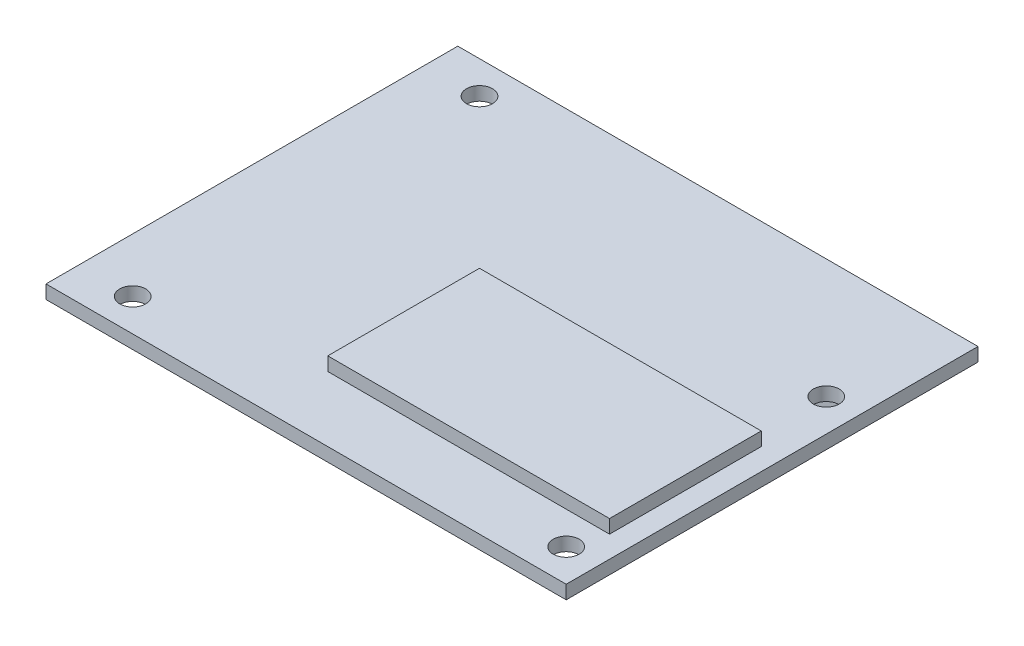
ISO-10303-21;
HEADER;
FILE_DESCRIPTION(('STEP AP214'),'2;1');
FILE_NAME('part.step','',(''),(''),'','','');
FILE_SCHEMA(('AUTOMOTIVE_DESIGN { 1 0 10303 214 1 1 1 1 }'));
ENDSEC;
DATA;
#1=APPLICATION_CONTEXT('core data for automotive mechanical design processes');
#2=APPLICATION_PROTOCOL_DEFINITION('international standard','automotive_design',2000,#1);
#3=PRODUCT_CONTEXT('',#1,'mechanical');
#4=PRODUCT('Part','Part','',(#3));
#5=PRODUCT_RELATED_PRODUCT_CATEGORY('part','',(#4));
#6=PRODUCT_DEFINITION_FORMATION('','',#4);
#7=PRODUCT_DEFINITION_CONTEXT('part definition',#1,'design');
#8=PRODUCT_DEFINITION('design','',#6,#7);
#9=PRODUCT_DEFINITION_SHAPE('','',#8);
#10=(LENGTH_UNIT() NAMED_UNIT(*) SI_UNIT(.MILLI.,.METRE.));
#11=(NAMED_UNIT(*) PLANE_ANGLE_UNIT() SI_UNIT($,.RADIAN.));
#12=(NAMED_UNIT(*) SI_UNIT($,.STERADIAN.) SOLID_ANGLE_UNIT());
#13=UNCERTAINTY_MEASURE_WITH_UNIT(LENGTH_MEASURE(1.E-05),#10,'distance_accuracy_value','');
#14=(GEOMETRIC_REPRESENTATION_CONTEXT(3) GLOBAL_UNCERTAINTY_ASSIGNED_CONTEXT((#13)) GLOBAL_UNIT_ASSIGNED_CONTEXT((#10,
#11,#12)) REPRESENTATION_CONTEXT('',''));
#15=CARTESIAN_POINT('',(0.,0.,0.));
#16=DIRECTION('',(0.,0.,1.));
#17=DIRECTION('',(1.,0.,0.));
#18=AXIS2_PLACEMENT_3D('',#15,#16,#17);
#19=CARTESIAN_POINT('',(0.,0.,0.));
#20=DIRECTION('',(0.,1.,0.));
#21=DIRECTION('',(0.,0.,1.));
#22=AXIS2_PLACEMENT_3D('',#19,#20,#21);
#23=PLANE('',#22);
#24=DIRECTION('',(0.,0.,1.));
#25=VECTOR('',#24,1.);
#26=CARTESIAN_POINT('',(-29.4723855401664,0.,-18.6705179282869));
#27=LINE('',#26,#25);
#28=CARTESIAN_POINT('',(-29.4723855401664,0.,-18.6705179282869));
#29=VERTEX_POINT('',#28);
#30=CARTESIAN_POINT('',(-29.4723855401664,0.,29.5894820717131));
#31=VERTEX_POINT('',#30);
#32=EDGE_CURVE('E238',#29,#31,#27,.T.);
#33=ORIENTED_EDGE('',*,*,#32,.F.);
#34=DIRECTION('',(-1.,0.,0.));
#35=VECTOR('',#34,1.);
#36=CARTESIAN_POINT('',(-29.4723855401664,0.,-18.6705179282869));
#37=LINE('',#36,#35);
#38=CARTESIAN_POINT('',(31.4876144598336,0.,-18.6705179282869));
#39=VERTEX_POINT('',#38);
#40=EDGE_CURVE('E244',#39,#29,#37,.T.);
#41=ORIENTED_EDGE('',*,*,#40,.F.);
#42=DIRECTION('',(0.,0.,-1.));
#43=VECTOR('',#42,1.);
#44=CARTESIAN_POINT('',(31.4876144598336,0.,-18.6705179282869));
#45=LINE('',#44,#43);
#46=CARTESIAN_POINT('',(31.4876144598336,0.,29.5894820717131));
#47=VERTEX_POINT('',#46);
#48=EDGE_CURVE('E260',#47,#39,#45,.T.);
#49=ORIENTED_EDGE('',*,*,#48,.F.);
#50=DIRECTION('',(1.,0.,0.));
#51=VECTOR('',#50,1.);
#52=CARTESIAN_POINT('',(-29.4723855401664,0.,29.5894820717131));
#53=LINE('',#52,#51);
#54=EDGE_CURVE('E257',#31,#47,#53,.T.);
#55=ORIENTED_EDGE('',*,*,#54,.F.);
#56=EDGE_LOOP('',(#33,#41,#49,#55));
#57=FACE_BOUND('',#56,.T.);
#58=CARTESIAN_POINT('',(27.6776144598336,0.,-4.70051792828686));
#59=DIRECTION('',(0.,1.,0.));
#60=DIRECTION('',(0.,0.,1.));
#61=AXIS2_PLACEMENT_3D('',#58,#59,#60);
#62=CIRCLE('',#61,1.52399999999999);
#63=CARTESIAN_POINT('',(27.6776144598336,0.,-3.17651792828687));
#64=VERTEX_POINT('',#63);
#65=EDGE_CURVE('E175',#64,#64,#62,.T.);
#66=ORIENTED_EDGE('',*,*,#65,.T.);
#67=EDGE_LOOP('',(#66));
#68=FACE_BOUND('',#67,.T.);
#69=CARTESIAN_POINT('',(-23.1223855401664,0.,25.7794820717131));
#70=DIRECTION('',(0.,1.,0.));
#71=DIRECTION('',(0.,0.,1.));
#72=AXIS2_PLACEMENT_3D('',#69,#70,#71);
#73=CIRCLE('',#72,1.52399999999999);
#74=CARTESIAN_POINT('',(-23.1223855401664,0.,27.3034820717131));
#75=VERTEX_POINT('',#74);
#76=EDGE_CURVE('E187',#75,#75,#73,.T.);
#77=ORIENTED_EDGE('',*,*,#76,.T.);
#78=EDGE_LOOP('',(#77));
#79=FACE_BOUND('',#78,.T.);
#80=CARTESIAN_POINT('',(27.6776144598336,0.,25.7794820717131));
#81=DIRECTION('',(0.,1.,0.));
#82=DIRECTION('',(0.,0.,1.));
#83=AXIS2_PLACEMENT_3D('',#80,#81,#82);
#84=CIRCLE('',#83,1.52399999999999);
#85=CARTESIAN_POINT('',(27.6776144598336,0.,27.3034820717131));
#86=VERTEX_POINT('',#85);
#87=EDGE_CURVE('E160',#86,#86,#84,.T.);
#88=ORIENTED_EDGE('',*,*,#87,.T.);
#89=EDGE_LOOP('',(#88));
#90=FACE_BOUND('',#89,.T.);
#91=CARTESIAN_POINT('',(-23.1223855401664,0.,-14.8605179282869));
#92=DIRECTION('',(0.,1.,0.));
#93=DIRECTION('',(0.,0.,1.));
#94=AXIS2_PLACEMENT_3D('',#91,#92,#93);
#95=CIRCLE('',#94,1.52399999999999);
#96=CARTESIAN_POINT('',(-23.1223855401664,0.,-13.3365179282869));
#97=VERTEX_POINT('',#96);
#98=EDGE_CURVE('E166',#97,#97,#95,.T.);
#99=ORIENTED_EDGE('',*,*,#98,.T.);
#100=EDGE_LOOP('',(#99));
#101=FACE_BOUND('',#100,.T.);
#102=DIRECTION('',(0.,0.,-1.));
#103=VECTOR('',#102,1.);
#104=CARTESIAN_POINT('',(8.62761445983358,0.,-13.5905179282869));
#105=LINE('',#104,#103);
#106=CARTESIAN_POINT('',(8.62761445983358,0.,-13.5905179282869));
#107=VERTEX_POINT('',#106);
#108=CARTESIAN_POINT('',(8.62761445983358,0.,-16.1305179282869));
#109=VERTEX_POINT('',#108);
#110=EDGE_CURVE('E153',#107,#109,#105,.T.);
#111=ORIENTED_EDGE('',*,*,#110,.F.);
#112=DIRECTION('',(-1.,0.,0.));
#113=VECTOR('',#112,1.);
#114=CARTESIAN_POINT('',(8.62761445983358,0.,-13.5905179282869));
#115=LINE('',#114,#113);
#116=CARTESIAN_POINT('',(21.3276144598336,0.,-13.5905179282869));
#117=VERTEX_POINT('',#116);
#118=EDGE_CURVE('E150',#117,#107,#115,.T.);
#119=ORIENTED_EDGE('',*,*,#118,.F.);
#120=DIRECTION('',(0.,0.,1.));
#121=VECTOR('',#120,1.);
#122=CARTESIAN_POINT('',(21.3276144598336,0.,-13.5905179282869));
#123=LINE('',#122,#121);
#124=CARTESIAN_POINT('',(21.3276144598336,0.,-16.1305179282869));
#125=VERTEX_POINT('',#124);
#126=EDGE_CURVE('E62',#125,#117,#123,.T.);
#127=ORIENTED_EDGE('',*,*,#126,.F.);
#128=DIRECTION('',(1.,0.,0.));
#129=VECTOR('',#128,1.);
#130=CARTESIAN_POINT('',(8.62761445983358,0.,-16.1305179282869));
#131=LINE('',#130,#129);
#132=EDGE_CURVE('E57',#109,#125,#131,.T.);
#133=ORIENTED_EDGE('',*,*,#132,.F.);
#134=EDGE_LOOP('',(#111,#119,#127,#133));
#135=FACE_BOUND('',#134,.T.);
#136=ADVANCED_FACE('F41',(#57,#68,#79,#90,#101,#135),#23,.F.);
#137=CARTESIAN_POINT('',(-29.4723855401664,1.5875,-18.6705179282869));
#138=DIRECTION('',(1.,0.,0.));
#139=DIRECTION('',(0.,0.,-1.));
#140=AXIS2_PLACEMENT_3D('',#137,#138,#139);
#141=PLANE('',#140);
#142=ORIENTED_EDGE('',*,*,#32,.T.);
#143=DIRECTION('',(0.,-1.,0.));
#144=VECTOR('',#143,1.);
#145=CARTESIAN_POINT('',(-29.4723855401664,1.5875,29.5894820717131));
#146=LINE('',#145,#144);
#147=CARTESIAN_POINT('',(-29.4723855401664,1.5875,29.5894820717131));
#148=VERTEX_POINT('',#147);
#149=EDGE_CURVE('E11',#148,#31,#146,.T.);
#150=ORIENTED_EDGE('',*,*,#149,.F.);
#151=DIRECTION('',(0.,0.,1.));
#152=VECTOR('',#151,1.);
#153=CARTESIAN_POINT('',(-29.4723855401664,1.5875,-18.6705179282869));
#154=LINE('',#153,#152);
#155=CARTESIAN_POINT('',(-29.4723855401664,1.5875,-18.6705179282869));
#156=VERTEX_POINT('',#155);
#157=EDGE_CURVE('E239',#156,#148,#154,.T.);
#158=ORIENTED_EDGE('',*,*,#157,.F.);
#159=DIRECTION('',(0.,-1.,0.));
#160=VECTOR('',#159,1.);
#161=CARTESIAN_POINT('',(-29.4723855401664,1.5875,-18.6705179282869));
#162=LINE('',#161,#160);
#163=EDGE_CURVE('E253',#156,#29,#162,.T.);
#164=ORIENTED_EDGE('',*,*,#163,.T.);
#165=EDGE_LOOP('',(#142,#150,#158,#164));
#166=FACE_BOUND('',#165,.T.);
#167=ADVANCED_FACE('F43',(#166),#141,.F.);
#168=CARTESIAN_POINT('',(-29.4723855401664,1.5875,29.5894820717131));
#169=DIRECTION('',(0.,0.,-1.));
#170=DIRECTION('',(-1.,0.,0.));
#171=AXIS2_PLACEMENT_3D('',#168,#169,#170);
#172=PLANE('',#171);
#173=ORIENTED_EDGE('',*,*,#54,.T.);
#174=DIRECTION('',(0.,-1.,0.));
#175=VECTOR('',#174,1.);
#176=CARTESIAN_POINT('',(31.4876144598336,1.5875,29.5894820717131));
#177=LINE('',#176,#175);
#178=CARTESIAN_POINT('',(31.4876144598336,1.5875,29.5894820717131));
#179=VERTEX_POINT('',#178);
#180=EDGE_CURVE('E50',#179,#47,#177,.T.);
#181=ORIENTED_EDGE('',*,*,#180,.F.);
#182=DIRECTION('',(1.,0.,0.));
#183=VECTOR('',#182,1.);
#184=CARTESIAN_POINT('',(-29.4723855401664,1.5875,29.5894820717131));
#185=LINE('',#184,#183);
#186=EDGE_CURVE('E243',#148,#179,#185,.T.);
#187=ORIENTED_EDGE('',*,*,#186,.F.);
#188=ORIENTED_EDGE('',*,*,#149,.T.);
#189=EDGE_LOOP('',(#173,#181,#187,#188));
#190=FACE_BOUND('',#189,.T.);
#191=ADVANCED_FACE('F293',(#190),#172,.F.);
#192=CARTESIAN_POINT('',(31.4876144598336,1.5875,-18.6705179282869));
#193=DIRECTION('',(-1.,0.,0.));
#194=DIRECTION('',(0.,0.,1.));
#195=AXIS2_PLACEMENT_3D('',#192,#193,#194);
#196=PLANE('',#195);
#197=ORIENTED_EDGE('',*,*,#48,.T.);
#198=DIRECTION('',(0.,-1.,0.));
#199=VECTOR('',#198,1.);
#200=CARTESIAN_POINT('',(31.4876144598336,1.5875,-18.6705179282869));
#201=LINE('',#200,#199);
#202=CARTESIAN_POINT('',(31.4876144598336,1.5875,-18.6705179282869));
#203=VERTEX_POINT('',#202);
#204=EDGE_CURVE('E268',#203,#39,#201,.T.);
#205=ORIENTED_EDGE('',*,*,#204,.F.);
#206=DIRECTION('',(0.,0.,-1.));
#207=VECTOR('',#206,1.);
#208=CARTESIAN_POINT('',(31.4876144598336,1.5875,-18.6705179282869));
#209=LINE('',#208,#207);
#210=EDGE_CURVE('E247',#179,#203,#209,.T.);
#211=ORIENTED_EDGE('',*,*,#210,.F.);
#212=ORIENTED_EDGE('',*,*,#180,.T.);
#213=EDGE_LOOP('',(#197,#205,#211,#212));
#214=FACE_BOUND('',#213,.T.);
#215=ADVANCED_FACE('F277',(#214),#196,.F.);
#216=CARTESIAN_POINT('',(-29.4723855401664,1.5875,-18.6705179282869));
#217=DIRECTION('',(0.,0.,1.));
#218=DIRECTION('',(1.,0.,0.));
#219=AXIS2_PLACEMENT_3D('',#216,#217,#218);
#220=PLANE('',#219);
#221=ORIENTED_EDGE('',*,*,#40,.T.);
#222=ORIENTED_EDGE('',*,*,#163,.F.);
#223=DIRECTION('',(-1.,0.,0.));
#224=VECTOR('',#223,1.);
#225=CARTESIAN_POINT('',(-29.4723855401664,1.5875,-18.6705179282869));
#226=LINE('',#225,#224);
#227=EDGE_CURVE('E250',#203,#156,#226,.T.);
#228=ORIENTED_EDGE('',*,*,#227,.F.);
#229=ORIENTED_EDGE('',*,*,#204,.T.);
#230=EDGE_LOOP('',(#221,#222,#228,#229));
#231=FACE_BOUND('',#230,.T.);
#232=ADVANCED_FACE('F286',(#231),#220,.F.);
#233=CARTESIAN_POINT('',(0.,1.5875,0.));
#234=DIRECTION('',(0.,1.,0.));
#235=DIRECTION('',(0.,0.,1.));
#236=AXIS2_PLACEMENT_3D('',#233,#234,#235);
#237=PLANE('',#236);
#238=CARTESIAN_POINT('',(-23.1223855401664,1.5875,-14.8605179282869));
#239=DIRECTION('',(0.,1.,0.));
#240=DIRECTION('',(0.,0.,1.));
#241=AXIS2_PLACEMENT_3D('',#238,#239,#240);
#242=CIRCLE('',#241,1.52399999999999);
#243=CARTESIAN_POINT('',(-23.1223855401664,1.5875,-13.3365179282869));
#244=VERTEX_POINT('',#243);
#245=EDGE_CURVE('E171',#244,#244,#242,.T.);
#246=ORIENTED_EDGE('',*,*,#245,.F.);
#247=EDGE_LOOP('',(#246));
#248=FACE_BOUND('',#247,.T.);
#249=CARTESIAN_POINT('',(27.6776144598336,1.5875,25.7794820717131));
#250=DIRECTION('',(0.,1.,0.));
#251=DIRECTION('',(0.,0.,1.));
#252=AXIS2_PLACEMENT_3D('',#249,#250,#251);
#253=CIRCLE('',#252,1.52399999999999);
#254=CARTESIAN_POINT('',(27.6776144598336,1.5875,27.3034820717131));
#255=VERTEX_POINT('',#254);
#256=EDGE_CURVE('E155',#255,#255,#253,.T.);
#257=ORIENTED_EDGE('',*,*,#256,.F.);
#258=EDGE_LOOP('',(#257));
#259=FACE_BOUND('',#258,.T.);
#260=CARTESIAN_POINT('',(-23.1223855401664,1.5875,25.7794820717131));
#261=DIRECTION('',(0.,1.,0.));
#262=DIRECTION('',(0.,0.,1.));
#263=AXIS2_PLACEMENT_3D('',#260,#261,#262);
#264=CIRCLE('',#263,1.52399999999999);
#265=CARTESIAN_POINT('',(-23.1223855401664,1.5875,27.3034820717131));
#266=VERTEX_POINT('',#265);
#267=EDGE_CURVE('E178',#266,#266,#264,.T.);
#268=ORIENTED_EDGE('',*,*,#267,.F.);
#269=EDGE_LOOP('',(#268));
#270=FACE_BOUND('',#269,.T.);
#271=CARTESIAN_POINT('',(27.6776144598336,1.5875,-4.70051792828686));
#272=DIRECTION('',(0.,1.,0.));
#273=DIRECTION('',(0.,0.,1.));
#274=AXIS2_PLACEMENT_3D('',#271,#272,#273);
#275=CIRCLE('',#274,1.52399999999999);
#276=CARTESIAN_POINT('',(27.6776144598336,1.5875,-3.17651792828687));
#277=VERTEX_POINT('',#276);
#278=EDGE_CURVE('E183',#277,#277,#275,.T.);
#279=ORIENTED_EDGE('',*,*,#278,.F.);
#280=EDGE_LOOP('',(#279));
#281=FACE_BOUND('',#280,.T.);
#282=DIRECTION('',(0.,0.,1.));
#283=VECTOR('',#282,1.);
#284=CARTESIAN_POINT('',(-4.07238554016643,1.5875,4.18948207171314));
#285=LINE('',#284,#283);
#286=CARTESIAN_POINT('',(-4.07238554016643,1.5875,4.18948207171314));
#287=VERTEX_POINT('',#286);
#288=CARTESIAN_POINT('',(-4.07238554016642,1.5875,21.9694820717131));
#289=VERTEX_POINT('',#288);
#290=EDGE_CURVE('E170',#287,#289,#285,.T.);
#291=ORIENTED_EDGE('',*,*,#290,.F.);
#292=DIRECTION('',(-1.,0.,0.));
#293=VECTOR('',#292,1.);
#294=CARTESIAN_POINT('',(-4.07238554016643,1.5875,4.18948207171314));
#295=LINE('',#294,#293);
#296=CARTESIAN_POINT('',(28.9476144598336,1.5875,4.18948207171314));
#297=VERTEX_POINT('',#296);
#298=EDGE_CURVE('E199',#297,#287,#295,.T.);
#299=ORIENTED_EDGE('',*,*,#298,.F.);
#300=DIRECTION('',(0.,0.,-1.));
#301=VECTOR('',#300,1.);
#302=CARTESIAN_POINT('',(28.9476144598336,1.5875,4.18948207171314));
#303=LINE('',#302,#301);
#304=CARTESIAN_POINT('',(28.9476144598336,1.5875,21.9694820717131));
#305=VERTEX_POINT('',#304);
#306=EDGE_CURVE('E216',#305,#297,#303,.T.);
#307=ORIENTED_EDGE('',*,*,#306,.F.);
#308=DIRECTION('',(1.,0.,0.));
#309=VECTOR('',#308,1.);
#310=CARTESIAN_POINT('',(-4.07238554016642,1.5875,21.9694820717131));
#311=LINE('',#310,#309);
#312=EDGE_CURVE('E212',#289,#305,#311,.T.);
#313=ORIENTED_EDGE('',*,*,#312,.F.);
#314=EDGE_LOOP('',(#291,#299,#307,#313));
#315=FACE_BOUND('',#314,.T.);
#316=ORIENTED_EDGE('',*,*,#157,.T.);
#317=ORIENTED_EDGE('',*,*,#186,.T.);
#318=ORIENTED_EDGE('',*,*,#210,.T.);
#319=ORIENTED_EDGE('',*,*,#227,.T.);
#320=EDGE_LOOP('',(#316,#317,#318,#319));
#321=FACE_BOUND('',#320,.T.);
#322=ADVANCED_FACE('F292',(#248,#259,#270,#281,#315,#321),#237,.T.);
#323=CARTESIAN_POINT('',(-4.07238554016643,3.175,4.18948207171314));
#324=DIRECTION('',(1.,0.,0.));
#325=DIRECTION('',(0.,0.,-1.));
#326=AXIS2_PLACEMENT_3D('',#323,#324,#325);
#327=PLANE('',#326);
#328=ORIENTED_EDGE('',*,*,#290,.T.);
#329=DIRECTION('',(0.,-1.,0.));
#330=VECTOR('',#329,1.);
#331=CARTESIAN_POINT('',(-4.07238554016642,3.175,21.9694820717131));
#332=LINE('',#331,#330);
#333=CARTESIAN_POINT('',(-4.07238554016642,3.175,21.9694820717131));
#334=VERTEX_POINT('',#333);
#335=EDGE_CURVE('E234',#334,#289,#332,.T.);
#336=ORIENTED_EDGE('',*,*,#335,.F.);
#337=DIRECTION('',(0.,0.,1.));
#338=VECTOR('',#337,1.);
#339=CARTESIAN_POINT('',(-4.07238554016643,3.175,4.18948207171314));
#340=LINE('',#339,#338);
#341=CARTESIAN_POINT('',(-4.07238554016643,3.175,4.18948207171314));
#342=VERTEX_POINT('',#341);
#343=EDGE_CURVE('E194',#342,#334,#340,.T.);
#344=ORIENTED_EDGE('',*,*,#343,.F.);
#345=DIRECTION('',(0.,-1.,0.));
#346=VECTOR('',#345,1.);
#347=CARTESIAN_POINT('',(-4.07238554016643,3.175,4.18948207171314));
#348=LINE('',#347,#346);
#349=EDGE_CURVE('E208',#342,#287,#348,.T.);
#350=ORIENTED_EDGE('',*,*,#349,.T.);
#351=EDGE_LOOP('',(#328,#336,#344,#350));
#352=FACE_BOUND('',#351,.T.);
#353=ADVANCED_FACE('F311',(#352),#327,.F.);
#354=CARTESIAN_POINT('',(-4.07238554016642,3.175,21.9694820717131));
#355=DIRECTION('',(0.,0.,-1.));
#356=DIRECTION('',(-1.,0.,0.));
#357=AXIS2_PLACEMENT_3D('',#354,#355,#356);
#358=PLANE('',#357);
#359=ORIENTED_EDGE('',*,*,#312,.T.);
#360=DIRECTION('',(0.,-1.,0.));
#361=VECTOR('',#360,1.);
#362=CARTESIAN_POINT('',(28.9476144598336,3.175,21.9694820717131));
#363=LINE('',#362,#361);
#364=CARTESIAN_POINT('',(28.9476144598336,3.175,21.9694820717131));
#365=VERTEX_POINT('',#364);
#366=EDGE_CURVE('E230',#365,#305,#363,.T.);
#367=ORIENTED_EDGE('',*,*,#366,.F.);
#368=DIRECTION('',(1.,0.,0.));
#369=VECTOR('',#368,1.);
#370=CARTESIAN_POINT('',(-4.07238554016642,3.175,21.9694820717131));
#371=LINE('',#370,#369);
#372=EDGE_CURVE('E198',#334,#365,#371,.T.);
#373=ORIENTED_EDGE('',*,*,#372,.F.);
#374=ORIENTED_EDGE('',*,*,#335,.T.);
#375=EDGE_LOOP('',(#359,#367,#373,#374));
#376=FACE_BOUND('',#375,.T.);
#377=ADVANCED_FACE('F316',(#376),#358,.F.);
#378=CARTESIAN_POINT('',(28.9476144598336,3.175,4.18948207171314));
#379=DIRECTION('',(-1.,0.,0.));
#380=DIRECTION('',(0.,0.,1.));
#381=AXIS2_PLACEMENT_3D('',#378,#379,#380);
#382=PLANE('',#381);
#383=ORIENTED_EDGE('',*,*,#306,.T.);
#384=DIRECTION('',(0.,-1.,0.));
#385=VECTOR('',#384,1.);
#386=CARTESIAN_POINT('',(28.9476144598336,3.175,4.18948207171314));
#387=LINE('',#386,#385);
#388=CARTESIAN_POINT('',(28.9476144598336,3.175,4.18948207171314));
#389=VERTEX_POINT('',#388);
#390=EDGE_CURVE('E226',#389,#297,#387,.T.);
#391=ORIENTED_EDGE('',*,*,#390,.F.);
#392=DIRECTION('',(0.,0.,-1.));
#393=VECTOR('',#392,1.);
#394=CARTESIAN_POINT('',(28.9476144598336,3.175,4.18948207171314));
#395=LINE('',#394,#393);
#396=EDGE_CURVE('E202',#365,#389,#395,.T.);
#397=ORIENTED_EDGE('',*,*,#396,.F.);
#398=ORIENTED_EDGE('',*,*,#366,.T.);
#399=EDGE_LOOP('',(#383,#391,#397,#398));
#400=FACE_BOUND('',#399,.T.);
#401=ADVANCED_FACE('F338',(#400),#382,.F.);
#402=CARTESIAN_POINT('',(-4.07238554016643,3.175,4.18948207171314));
#403=DIRECTION('',(0.,0.,1.));
#404=DIRECTION('',(1.,0.,0.));
#405=AXIS2_PLACEMENT_3D('',#402,#403,#404);
#406=PLANE('',#405);
#407=ORIENTED_EDGE('',*,*,#298,.T.);
#408=ORIENTED_EDGE('',*,*,#349,.F.);
#409=DIRECTION('',(-1.,0.,0.));
#410=VECTOR('',#409,1.);
#411=CARTESIAN_POINT('',(-4.07238554016643,3.175,4.18948207171314));
#412=LINE('',#411,#410);
#413=EDGE_CURVE('E205',#389,#342,#412,.T.);
#414=ORIENTED_EDGE('',*,*,#413,.F.);
#415=ORIENTED_EDGE('',*,*,#390,.T.);
#416=EDGE_LOOP('',(#407,#408,#414,#415));
#417=FACE_BOUND('',#416,.T.);
#418=ADVANCED_FACE('F329',(#417),#406,.F.);
#419=CARTESIAN_POINT('',(0.,3.175,0.));
#420=DIRECTION('',(0.,1.,0.));
#421=DIRECTION('',(0.,0.,1.));
#422=AXIS2_PLACEMENT_3D('',#419,#420,#421);
#423=PLANE('',#422);
#424=ORIENTED_EDGE('',*,*,#343,.T.);
#425=ORIENTED_EDGE('',*,*,#372,.T.);
#426=ORIENTED_EDGE('',*,*,#396,.T.);
#427=ORIENTED_EDGE('',*,*,#413,.T.);
#428=EDGE_LOOP('',(#424,#425,#426,#427));
#429=FACE_BOUND('',#428,.T.);
#430=ADVANCED_FACE('F334',(#429),#423,.T.);
#431=CARTESIAN_POINT('',(27.6776144598336,0.,-4.70051792828686));
#432=DIRECTION('',(0.,1.,0.));
#433=DIRECTION('',(0.,0.,1.));
#434=AXIS2_PLACEMENT_3D('',#431,#432,#433);
#435=CYLINDRICAL_SURFACE('',#434,1.52399999999999);
#436=ORIENTED_EDGE('',*,*,#65,.F.);
#437=EDGE_LOOP('',(#436));
#438=FACE_BOUND('',#437,.T.);
#439=ORIENTED_EDGE('',*,*,#278,.T.);
#440=EDGE_LOOP('',(#439));
#441=FACE_BOUND('',#440,.T.);
#442=ADVANCED_FACE('F351',(#438,#441),#435,.F.);
#443=CARTESIAN_POINT('',(-23.1223855401664,0.,25.7794820717131));
#444=DIRECTION('',(0.,1.,0.));
#445=DIRECTION('',(0.,0.,1.));
#446=AXIS2_PLACEMENT_3D('',#443,#444,#445);
#447=CYLINDRICAL_SURFACE('',#446,1.52399999999999);
#448=ORIENTED_EDGE('',*,*,#76,.F.);
#449=EDGE_LOOP('',(#448));
#450=FACE_BOUND('',#449,.T.);
#451=ORIENTED_EDGE('',*,*,#267,.T.);
#452=EDGE_LOOP('',(#451));
#453=FACE_BOUND('',#452,.T.);
#454=ADVANCED_FACE('F352',(#450,#453),#447,.F.);
#455=CARTESIAN_POINT('',(27.6776144598336,0.,25.7794820717131));
#456=DIRECTION('',(0.,1.,0.));
#457=DIRECTION('',(0.,0.,1.));
#458=AXIS2_PLACEMENT_3D('',#455,#456,#457);
#459=CYLINDRICAL_SURFACE('',#458,1.52399999999999);
#460=ORIENTED_EDGE('',*,*,#87,.F.);
#461=EDGE_LOOP('',(#460));
#462=FACE_BOUND('',#461,.T.);
#463=ORIENTED_EDGE('',*,*,#256,.T.);
#464=EDGE_LOOP('',(#463));
#465=FACE_BOUND('',#464,.T.);
#466=ADVANCED_FACE('F355',(#462,#465),#459,.F.);
#467=CARTESIAN_POINT('',(-23.1223855401664,0.,-14.8605179282869));
#468=DIRECTION('',(0.,1.,0.));
#469=DIRECTION('',(0.,0.,1.));
#470=AXIS2_PLACEMENT_3D('',#467,#468,#469);
#471=CYLINDRICAL_SURFACE('',#470,1.52399999999999);
#472=ORIENTED_EDGE('',*,*,#98,.F.);
#473=EDGE_LOOP('',(#472));
#474=FACE_BOUND('',#473,.T.);
#475=ORIENTED_EDGE('',*,*,#245,.T.);
#476=EDGE_LOOP('',(#475));
#477=FACE_BOUND('',#476,.T.);
#478=ADVANCED_FACE('F362',(#474,#477),#471,.F.);
#479=CARTESIAN_POINT('',(8.62761445983358,-10.16,-13.5905179282869));
#480=DIRECTION('',(1.,0.,0.));
#481=DIRECTION('',(0.,0.,-1.));
#482=AXIS2_PLACEMENT_3D('',#479,#480,#481);
#483=PLANE('',#482);
#484=ORIENTED_EDGE('',*,*,#110,.T.);
#485=DIRECTION('',(0.,1.,0.));
#486=VECTOR('',#485,1.);
#487=CARTESIAN_POINT('',(8.62761445983358,-10.16,-16.1305179282869));
#488=LINE('',#487,#486);
#489=CARTESIAN_POINT('',(8.62761445983358,-10.16,-16.1305179282869));
#490=VERTEX_POINT('',#489);
#491=EDGE_CURVE('E132',#490,#109,#488,.T.);
#492=ORIENTED_EDGE('',*,*,#491,.F.);
#493=DIRECTION('',(0.,0.,-1.));
#494=VECTOR('',#493,1.);
#495=CARTESIAN_POINT('',(8.62761445983358,-10.16,-13.5905179282869));
#496=LINE('',#495,#494);
#497=CARTESIAN_POINT('',(8.62761445983358,-10.16,-13.5905179282869));
#498=VERTEX_POINT('',#497);
#499=EDGE_CURVE('E140',#498,#490,#496,.T.);
#500=ORIENTED_EDGE('',*,*,#499,.F.);
#501=DIRECTION('',(0.,1.,0.));
#502=VECTOR('',#501,1.);
#503=CARTESIAN_POINT('',(8.62761445983358,-10.16,-13.5905179282869));
#504=LINE('',#503,#502);
#505=EDGE_CURVE('E496',#498,#107,#504,.T.);
#506=ORIENTED_EDGE('',*,*,#505,.T.);
#507=EDGE_LOOP('',(#484,#492,#500,#506));
#508=FACE_BOUND('',#507,.T.);
#509=ADVANCED_FACE('F152',(#508),#483,.F.);
#510=CARTESIAN_POINT('',(8.62761445983358,-10.16,-16.1305179282869));
#511=DIRECTION('',(0.,0.,1.));
#512=DIRECTION('',(1.,0.,0.));
#513=AXIS2_PLACEMENT_3D('',#510,#511,#512);
#514=PLANE('',#513);
#515=ORIENTED_EDGE('',*,*,#132,.T.);
#516=DIRECTION('',(0.,1.,0.));
#517=VECTOR('',#516,1.);
#518=CARTESIAN_POINT('',(21.3276144598336,-10.16,-16.1305179282869));
#519=LINE('',#518,#517);
#520=CARTESIAN_POINT('',(21.3276144598336,-10.16,-16.1305179282869));
#521=VERTEX_POINT('',#520);
#522=EDGE_CURVE('E135',#521,#125,#519,.T.);
#523=ORIENTED_EDGE('',*,*,#522,.F.);
#524=DIRECTION('',(1.,0.,0.));
#525=VECTOR('',#524,1.);
#526=CARTESIAN_POINT('',(8.62761445983358,-10.16,-16.1305179282869));
#527=LINE('',#526,#525);
#528=EDGE_CURVE('E128',#490,#521,#527,.T.);
#529=ORIENTED_EDGE('',*,*,#528,.F.);
#530=ORIENTED_EDGE('',*,*,#491,.T.);
#531=EDGE_LOOP('',(#515,#523,#529,#530));
#532=FACE_BOUND('',#531,.T.);
#533=ADVANCED_FACE('F130',(#532),#514,.F.);
#534=CARTESIAN_POINT('',(21.3276144598336,-10.16,-13.5905179282869));
#535=DIRECTION('',(-1.,0.,0.));
#536=DIRECTION('',(0.,0.,1.));
#537=AXIS2_PLACEMENT_3D('',#534,#535,#536);
#538=PLANE('',#537);
#539=ORIENTED_EDGE('',*,*,#126,.T.);
#540=DIRECTION('',(0.,1.,0.));
#541=VECTOR('',#540,1.);
#542=CARTESIAN_POINT('',(21.3276144598336,-10.16,-13.5905179282869));
#543=LINE('',#542,#541);
#544=CARTESIAN_POINT('',(21.3276144598336,-10.16,-13.5905179282869));
#545=VERTEX_POINT('',#544);
#546=EDGE_CURVE('E162',#545,#117,#543,.T.);
#547=ORIENTED_EDGE('',*,*,#546,.F.);
#548=DIRECTION('',(0.,0.,1.));
#549=VECTOR('',#548,1.);
#550=CARTESIAN_POINT('',(21.3276144598336,-10.16,-13.5905179282869));
#551=LINE('',#550,#549);
#552=EDGE_CURVE('E139',#521,#545,#551,.T.);
#553=ORIENTED_EDGE('',*,*,#552,.F.);
#554=ORIENTED_EDGE('',*,*,#522,.T.);
#555=EDGE_LOOP('',(#539,#547,#553,#554));
#556=FACE_BOUND('',#555,.T.);
#557=ADVANCED_FACE('F371',(#556),#538,.F.);
#558=CARTESIAN_POINT('',(8.62761445983358,-10.16,-13.5905179282869));
#559=DIRECTION('',(0.,0.,-1.));
#560=DIRECTION('',(-1.,0.,0.));
#561=AXIS2_PLACEMENT_3D('',#558,#559,#560);
#562=PLANE('',#561);
#563=ORIENTED_EDGE('',*,*,#118,.T.);
#564=ORIENTED_EDGE('',*,*,#505,.F.);
#565=DIRECTION('',(-1.,0.,0.));
#566=VECTOR('',#565,1.);
#567=CARTESIAN_POINT('',(8.62761445983358,-10.16,-13.5905179282869));
#568=LINE('',#567,#566);
#569=EDGE_CURVE('E145',#545,#498,#568,.T.);
#570=ORIENTED_EDGE('',*,*,#569,.F.);
#571=ORIENTED_EDGE('',*,*,#546,.T.);
#572=EDGE_LOOP('',(#563,#564,#570,#571));
#573=FACE_BOUND('',#572,.T.);
#574=ADVANCED_FACE('F374',(#573),#562,.F.);
#575=CARTESIAN_POINT('',(0.,-10.16,0.));
#576=DIRECTION('',(0.,-1.,0.));
#577=DIRECTION('',(0.,0.,-1.));
#578=AXIS2_PLACEMENT_3D('',#575,#576,#577);
#579=PLANE('',#578);
#580=ORIENTED_EDGE('',*,*,#499,.T.);
#581=ORIENTED_EDGE('',*,*,#528,.T.);
#582=ORIENTED_EDGE('',*,*,#552,.T.);
#583=ORIENTED_EDGE('',*,*,#569,.T.);
#584=EDGE_LOOP('',(#580,#581,#582,#583));
#585=FACE_BOUND('',#584,.T.);
#586=ADVANCED_FACE('F143',(#585),#579,.T.);
#587=CLOSED_SHELL('',(#136,#167,#191,#215,#232,#322,#353,#377,#401,#418,#430,#442,#454,#466,
#478,#509,#533,#557,#574,#586));
#588=MANIFOLD_SOLID_BREP('B2',#587);
#589=ADVANCED_BREP_SHAPE_REPRESENTATION('',(#18,#588),#14);
#590=SHAPE_DEFINITION_REPRESENTATION(#9,#589);
ENDSEC;
END-ISO-10303-21;
